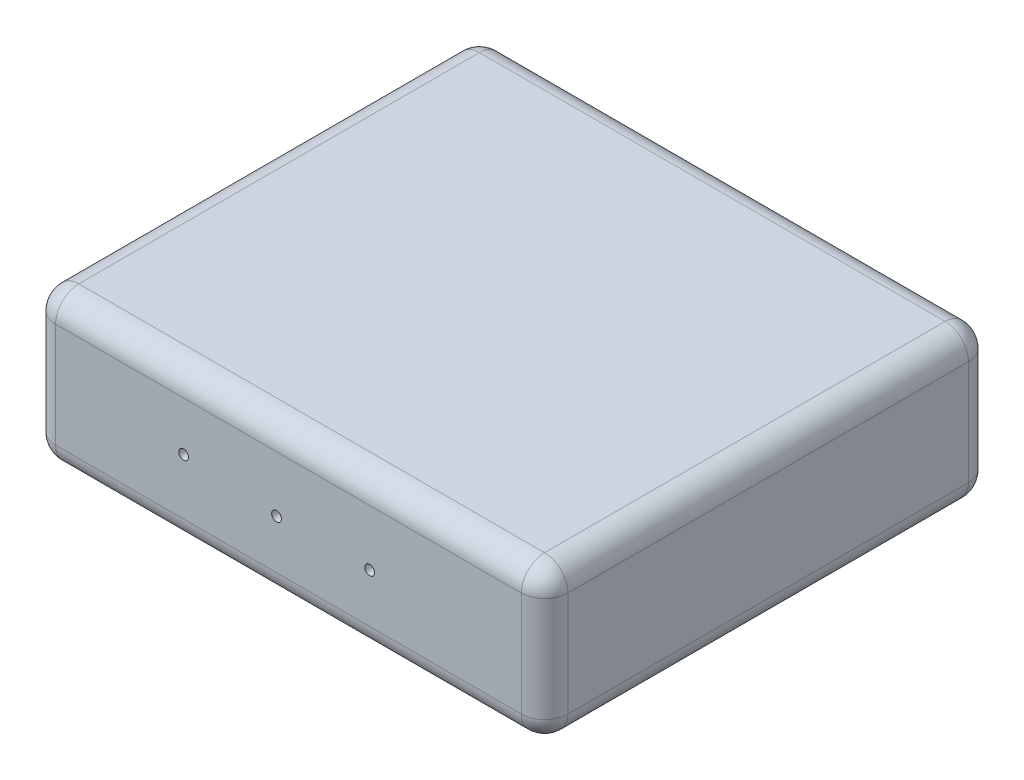
ISO-10303-21;
HEADER;
FILE_DESCRIPTION(('STEP AP214'),'2;1');
FILE_NAME('part.step','',(''),(''),'','','');
FILE_SCHEMA(('AUTOMOTIVE_DESIGN { 1 0 10303 214 1 1 1 1 }'));
ENDSEC;
DATA;
#1=APPLICATION_CONTEXT('core data for automotive mechanical design processes');
#2=APPLICATION_PROTOCOL_DEFINITION('international standard','automotive_design',2000,#1);
#3=PRODUCT_CONTEXT('',#1,'mechanical');
#4=PRODUCT('Part','Part','',(#3));
#5=PRODUCT_RELATED_PRODUCT_CATEGORY('part','',(#4));
#6=PRODUCT_DEFINITION_FORMATION('','',#4);
#7=PRODUCT_DEFINITION_CONTEXT('part definition',#1,'design');
#8=PRODUCT_DEFINITION('design','',#6,#7);
#9=PRODUCT_DEFINITION_SHAPE('','',#8);
#10=(LENGTH_UNIT() NAMED_UNIT(*) SI_UNIT(.MILLI.,.METRE.));
#11=(NAMED_UNIT(*) PLANE_ANGLE_UNIT() SI_UNIT($,.RADIAN.));
#12=(NAMED_UNIT(*) SI_UNIT($,.STERADIAN.) SOLID_ANGLE_UNIT());
#13=UNCERTAINTY_MEASURE_WITH_UNIT(LENGTH_MEASURE(1.E-05),#10,'distance_accuracy_value','');
#14=(GEOMETRIC_REPRESENTATION_CONTEXT(3) GLOBAL_UNCERTAINTY_ASSIGNED_CONTEXT((#13)) GLOBAL_UNIT_ASSIGNED_CONTEXT((#10,
#11,#12)) REPRESENTATION_CONTEXT('',''));
#15=CARTESIAN_POINT('',(0.,0.,0.));
#16=DIRECTION('',(0.,0.,1.));
#17=DIRECTION('',(1.,0.,0.));
#18=AXIS2_PLACEMENT_3D('',#15,#16,#17);
#19=CARTESIAN_POINT('',(-110.,65.,96.));
#20=DIRECTION('',(1.,0.,0.));
#21=DIRECTION('',(0.,0.,-1.));
#22=AXIS2_PLACEMENT_3D('',#19,#20,#21);
#23=PLANE('',#22);
#24=DIRECTION('',(0.,-1.,0.));
#25=VECTOR('',#24,1.);
#26=CARTESIAN_POINT('',(-110.,65.,-86.));
#27=LINE('',#26,#25);
#28=CARTESIAN_POINT('',(-110.,55.,-86.));
#29=VERTEX_POINT('',#28);
#30=CARTESIAN_POINT('',(-110.,10.,-86.));
#31=VERTEX_POINT('',#30);
#32=EDGE_CURVE('E227',#29,#31,#27,.T.);
#33=ORIENTED_EDGE('',*,*,#32,.T.);
#34=DIRECTION('',(0.,0.,1.));
#35=VECTOR('',#34,1.);
#36=CARTESIAN_POINT('',(-110.,10.,96.));
#37=LINE('',#36,#35);
#38=CARTESIAN_POINT('',(-110.,10.,86.));
#39=VERTEX_POINT('',#38);
#40=EDGE_CURVE('E229',#31,#39,#37,.T.);
#41=ORIENTED_EDGE('',*,*,#40,.T.);
#42=DIRECTION('',(0.,-1.,0.));
#43=VECTOR('',#42,1.);
#44=CARTESIAN_POINT('',(-110.,65.,86.));
#45=LINE('',#44,#43);
#46=CARTESIAN_POINT('',(-110.,55.,86.));
#47=VERTEX_POINT('',#46);
#48=EDGE_CURVE('E225',#39,#47,#45,.F.);
#49=ORIENTED_EDGE('',*,*,#48,.T.);
#50=DIRECTION('',(0.,0.,1.));
#51=VECTOR('',#50,1.);
#52=CARTESIAN_POINT('',(-110.,55.,-96.));
#53=LINE('',#52,#51);
#54=EDGE_CURVE('E223',#47,#29,#53,.F.);
#55=ORIENTED_EDGE('',*,*,#54,.T.);
#56=EDGE_LOOP('',(#33,#41,#49,#55));
#57=FACE_BOUND('',#56,.T.);
#58=ADVANCED_FACE('F33',(#57),#23,.F.);
#59=CARTESIAN_POINT('',(110.,65.,96.));
#60=DIRECTION('',(0.,0.,-1.));
#61=DIRECTION('',(-1.,0.,0.));
#62=AXIS2_PLACEMENT_3D('',#59,#60,#61);
#63=PLANE('',#62);
#64=CARTESIAN_POINT('',(-45.,34.,96.));
#65=DIRECTION('',(0.,0.,1.));
#66=DIRECTION('',(1.,0.,0.));
#67=AXIS2_PLACEMENT_3D('',#64,#65,#66);
#68=CIRCLE('',#67,2.1);
#69=CARTESIAN_POINT('',(-42.9,34.,96.));
#70=VERTEX_POINT('',#69);
#71=EDGE_CURVE('E168',#70,#70,#68,.T.);
#72=ORIENTED_EDGE('',*,*,#71,.F.);
#73=EDGE_LOOP('',(#72));
#74=FACE_BOUND('',#73,.T.);
#75=CARTESIAN_POINT('',(-5.11202760446174,31.0084020703346,96.));
#76=DIRECTION('',(0.,0.,1.));
#77=DIRECTION('',(1.,0.,0.));
#78=AXIS2_PLACEMENT_3D('',#75,#76,#77);
#79=CIRCLE('',#78,2.1);
#80=CARTESIAN_POINT('',(-3.01202760446174,31.0084020703346,96.));
#81=VERTEX_POINT('',#80);
#82=EDGE_CURVE('E174',#81,#81,#79,.T.);
#83=ORIENTED_EDGE('',*,*,#82,.F.);
#84=EDGE_LOOP('',(#83));
#85=FACE_BOUND('',#84,.T.);
#86=CARTESIAN_POINT('',(34.8879715180256,31.0000234660585,96.));
#87=DIRECTION('',(0.,0.,1.));
#88=DIRECTION('',(1.,0.,0.));
#89=AXIS2_PLACEMENT_3D('',#86,#87,#88);
#90=CIRCLE('',#89,2.1);
#91=CARTESIAN_POINT('',(36.9879715180256,31.0000234660585,96.));
#92=VERTEX_POINT('',#91);
#93=EDGE_CURVE('E180',#92,#92,#90,.T.);
#94=ORIENTED_EDGE('',*,*,#93,.F.);
#95=EDGE_LOOP('',(#94));
#96=FACE_BOUND('',#95,.T.);
#97=DIRECTION('',(1.,0.,0.));
#98=VECTOR('',#97,1.);
#99=CARTESIAN_POINT('',(110.,10.,96.));
#100=LINE('',#99,#98);
#101=CARTESIAN_POINT('',(-100.,10.,96.));
#102=VERTEX_POINT('',#101);
#103=CARTESIAN_POINT('',(100.,10.,96.));
#104=VERTEX_POINT('',#103);
#105=EDGE_CURVE('E200',#102,#104,#100,.T.);
#106=ORIENTED_EDGE('',*,*,#105,.T.);
#107=DIRECTION('',(0.,-1.,0.));
#108=VECTOR('',#107,1.);
#109=CARTESIAN_POINT('',(100.,65.,96.));
#110=LINE('',#109,#108);
#111=CARTESIAN_POINT('',(100.,55.,96.));
#112=VERTEX_POINT('',#111);
#113=EDGE_CURVE('E202',#104,#112,#110,.F.);
#114=ORIENTED_EDGE('',*,*,#113,.T.);
#115=DIRECTION('',(1.,0.,0.));
#116=VECTOR('',#115,1.);
#117=CARTESIAN_POINT('',(-110.,55.,96.));
#118=LINE('',#117,#116);
#119=CARTESIAN_POINT('',(-100.,55.,96.));
#120=VERTEX_POINT('',#119);
#121=EDGE_CURVE('E196',#112,#120,#118,.F.);
#122=ORIENTED_EDGE('',*,*,#121,.T.);
#123=DIRECTION('',(0.,-1.,0.));
#124=VECTOR('',#123,1.);
#125=CARTESIAN_POINT('',(-100.,65.,96.));
#126=LINE('',#125,#124);
#127=EDGE_CURVE('E198',#120,#102,#126,.T.);
#128=ORIENTED_EDGE('',*,*,#127,.T.);
#129=EDGE_LOOP('',(#106,#114,#122,#128));
#130=FACE_BOUND('',#129,.T.);
#131=ADVANCED_FACE('F374',(#74,#85,#96,#130),#63,.F.);
#132=CARTESIAN_POINT('',(110.,65.,96.));
#133=DIRECTION('',(-1.,0.,0.));
#134=DIRECTION('',(0.,0.,1.));
#135=AXIS2_PLACEMENT_3D('',#132,#133,#134);
#136=PLANE('',#135);
#137=DIRECTION('',(0.,0.,-1.));
#138=VECTOR('',#137,1.);
#139=CARTESIAN_POINT('',(110.,55.,96.));
#140=LINE('',#139,#138);
#141=CARTESIAN_POINT('',(110.,55.,-86.));
#142=VERTEX_POINT('',#141);
#143=CARTESIAN_POINT('',(110.,55.,86.));
#144=VERTEX_POINT('',#143);
#145=EDGE_CURVE('E187',#142,#144,#140,.F.);
#146=ORIENTED_EDGE('',*,*,#145,.T.);
#147=DIRECTION('',(0.,-1.,0.));
#148=VECTOR('',#147,1.);
#149=CARTESIAN_POINT('',(110.,65.,86.));
#150=LINE('',#149,#148);
#151=CARTESIAN_POINT('',(110.,10.,86.));
#152=VERTEX_POINT('',#151);
#153=EDGE_CURVE('E193',#144,#152,#150,.T.);
#154=ORIENTED_EDGE('',*,*,#153,.T.);
#155=DIRECTION('',(0.,0.,-1.));
#156=VECTOR('',#155,1.);
#157=CARTESIAN_POINT('',(110.,10.,96.));
#158=LINE('',#157,#156);
#159=CARTESIAN_POINT('',(110.,10.,-86.));
#160=VERTEX_POINT('',#159);
#161=EDGE_CURVE('E191',#152,#160,#158,.T.);
#162=ORIENTED_EDGE('',*,*,#161,.T.);
#163=DIRECTION('',(0.,-1.,0.));
#164=VECTOR('',#163,1.);
#165=CARTESIAN_POINT('',(110.,65.,-86.));
#166=LINE('',#165,#164);
#167=EDGE_CURVE('E189',#160,#142,#166,.F.);
#168=ORIENTED_EDGE('',*,*,#167,.T.);
#169=EDGE_LOOP('',(#146,#154,#162,#168));
#170=FACE_BOUND('',#169,.T.);
#171=ADVANCED_FACE('F332',(#170),#136,.F.);
#172=CARTESIAN_POINT('',(110.,65.,-96.));
#173=DIRECTION('',(0.,0.,1.));
#174=DIRECTION('',(1.,0.,0.));
#175=AXIS2_PLACEMENT_3D('',#172,#173,#174);
#176=PLANE('',#175);
#177=CARTESIAN_POINT('',(45.,34.,-96.));
#178=DIRECTION('',(0.,0.,-1.));
#179=DIRECTION('',(-1.,0.,0.));
#180=AXIS2_PLACEMENT_3D('',#177,#178,#179);
#181=CIRCLE('',#180,2.1);
#182=CARTESIAN_POINT('',(42.9,34.,-96.));
#183=VERTEX_POINT('',#182);
#184=EDGE_CURVE('E152',#183,#183,#181,.T.);
#185=ORIENTED_EDGE('',*,*,#184,.F.);
#186=EDGE_LOOP('',(#185));
#187=FACE_BOUND('',#186,.T.);
#188=CARTESIAN_POINT('',(5.11202760446174,31.0084020703346,-96.));
#189=DIRECTION('',(0.,0.,-1.));
#190=DIRECTION('',(-1.,0.,0.));
#191=AXIS2_PLACEMENT_3D('',#188,#189,#190);
#192=CIRCLE('',#191,2.1);
#193=CARTESIAN_POINT('',(3.01202760446174,31.0084020703346,-96.));
#194=VERTEX_POINT('',#193);
#195=EDGE_CURVE('E151',#194,#194,#192,.T.);
#196=ORIENTED_EDGE('',*,*,#195,.F.);
#197=EDGE_LOOP('',(#196));
#198=FACE_BOUND('',#197,.T.);
#199=CARTESIAN_POINT('',(-34.8879715180256,31.0000234660584,-96.));
#200=DIRECTION('',(0.,0.,-1.));
#201=DIRECTION('',(-1.,0.,0.));
#202=AXIS2_PLACEMENT_3D('',#199,#200,#201);
#203=CIRCLE('',#202,2.1);
#204=CARTESIAN_POINT('',(-36.9879715180256,31.0000234660584,-96.));
#205=VERTEX_POINT('',#204);
#206=EDGE_CURVE('E162',#205,#205,#203,.T.);
#207=ORIENTED_EDGE('',*,*,#206,.F.);
#208=EDGE_LOOP('',(#207));
#209=FACE_BOUND('',#208,.T.);
#210=DIRECTION('',(-1.,0.,0.));
#211=VECTOR('',#210,1.);
#212=CARTESIAN_POINT('',(110.,55.,-96.));
#213=LINE('',#212,#211);
#214=CARTESIAN_POINT('',(-100.,55.,-96.));
#215=VERTEX_POINT('',#214);
#216=CARTESIAN_POINT('',(100.,55.,-96.));
#217=VERTEX_POINT('',#216);
#218=EDGE_CURVE('E214',#215,#217,#213,.F.);
#219=ORIENTED_EDGE('',*,*,#218,.T.);
#220=DIRECTION('',(0.,-1.,0.));
#221=VECTOR('',#220,1.);
#222=CARTESIAN_POINT('',(100.,65.,-96.));
#223=LINE('',#222,#221);
#224=CARTESIAN_POINT('',(100.,10.,-96.));
#225=VERTEX_POINT('',#224);
#226=EDGE_CURVE('E220',#217,#225,#223,.T.);
#227=ORIENTED_EDGE('',*,*,#226,.T.);
#228=DIRECTION('',(-1.,0.,0.));
#229=VECTOR('',#228,1.);
#230=CARTESIAN_POINT('',(110.,10.,-96.));
#231=LINE('',#230,#229);
#232=CARTESIAN_POINT('',(-100.,10.,-96.));
#233=VERTEX_POINT('',#232);
#234=EDGE_CURVE('E218',#225,#233,#231,.T.);
#235=ORIENTED_EDGE('',*,*,#234,.T.);
#236=DIRECTION('',(0.,-1.,0.));
#237=VECTOR('',#236,1.);
#238=CARTESIAN_POINT('',(-100.,65.,-96.));
#239=LINE('',#238,#237);
#240=EDGE_CURVE('E216',#233,#215,#239,.F.);
#241=ORIENTED_EDGE('',*,*,#240,.T.);
#242=EDGE_LOOP('',(#219,#227,#235,#241));
#243=FACE_BOUND('',#242,.T.);
#244=ADVANCED_FACE('F346',(#187,#198,#209,#243),#176,.F.);
#245=CARTESIAN_POINT('',(0.,65.,0.));
#246=DIRECTION('',(0.,1.,0.));
#247=DIRECTION('',(0.,0.,1.));
#248=AXIS2_PLACEMENT_3D('',#245,#246,#247);
#249=PLANE('',#248);
#250=DIRECTION('',(1.,0.,0.));
#251=VECTOR('',#250,1.);
#252=CARTESIAN_POINT('',(110.,65.,86.));
#253=LINE('',#252,#251);
#254=CARTESIAN_POINT('',(-100.,65.,86.));
#255=VERTEX_POINT('',#254);
#256=CARTESIAN_POINT('',(100.,65.,86.));
#257=VERTEX_POINT('',#256);
#258=EDGE_CURVE('E232',#255,#257,#253,.T.);
#259=ORIENTED_EDGE('',*,*,#258,.T.);
#260=DIRECTION('',(0.,0.,-1.));
#261=VECTOR('',#260,1.);
#262=CARTESIAN_POINT('',(100.,65.,-96.));
#263=LINE('',#262,#261);
#264=CARTESIAN_POINT('',(100.,65.,-86.));
#265=VERTEX_POINT('',#264);
#266=EDGE_CURVE('E11',#257,#265,#263,.T.);
#267=ORIENTED_EDGE('',*,*,#266,.T.);
#268=DIRECTION('',(-1.,0.,0.));
#269=VECTOR('',#268,1.);
#270=CARTESIAN_POINT('',(-110.,65.,-86.));
#271=LINE('',#270,#269);
#272=CARTESIAN_POINT('',(-100.,65.,-86.));
#273=VERTEX_POINT('',#272);
#274=EDGE_CURVE('E42',#265,#273,#271,.T.);
#275=ORIENTED_EDGE('',*,*,#274,.T.);
#276=DIRECTION('',(0.,0.,1.));
#277=VECTOR('',#276,1.);
#278=CARTESIAN_POINT('',(-100.,65.,96.));
#279=LINE('',#278,#277);
#280=EDGE_CURVE('E234',#273,#255,#279,.T.);
#281=ORIENTED_EDGE('',*,*,#280,.T.);
#282=EDGE_LOOP('',(#259,#267,#275,#281));
#283=FACE_BOUND('',#282,.T.);
#284=ADVANCED_FACE('F315',(#283),#249,.T.);
#285=CARTESIAN_POINT('',(0.,0.,0.));
#286=DIRECTION('',(0.,1.,0.));
#287=DIRECTION('',(0.,0.,1.));
#288=AXIS2_PLACEMENT_3D('',#285,#286,#287);
#289=PLANE('',#288);
#290=DIRECTION('',(-1.,0.,0.));
#291=VECTOR('',#290,1.);
#292=CARTESIAN_POINT('',(0.,0.,-86.));
#293=LINE('',#292,#291);
#294=CARTESIAN_POINT('',(-100.,0.,-86.));
#295=VERTEX_POINT('',#294);
#296=CARTESIAN_POINT('',(100.,0.,-86.));
#297=VERTEX_POINT('',#296);
#298=EDGE_CURVE('E209',#295,#297,#293,.F.);
#299=ORIENTED_EDGE('',*,*,#298,.T.);
#300=DIRECTION('',(0.,0.,-1.));
#301=VECTOR('',#300,1.);
#302=CARTESIAN_POINT('',(100.,0.,0.));
#303=LINE('',#302,#301);
#304=CARTESIAN_POINT('',(100.,0.,86.));
#305=VERTEX_POINT('',#304);
#306=EDGE_CURVE('E211',#297,#305,#303,.F.);
#307=ORIENTED_EDGE('',*,*,#306,.T.);
#308=DIRECTION('',(1.,0.,0.));
#309=VECTOR('',#308,1.);
#310=CARTESIAN_POINT('',(0.,0.,86.));
#311=LINE('',#310,#309);
#312=CARTESIAN_POINT('',(-100.,0.,86.));
#313=VERTEX_POINT('',#312);
#314=EDGE_CURVE('E205',#305,#313,#311,.F.);
#315=ORIENTED_EDGE('',*,*,#314,.T.);
#316=DIRECTION('',(0.,0.,1.));
#317=VECTOR('',#316,1.);
#318=CARTESIAN_POINT('',(-100.,0.,0.));
#319=LINE('',#318,#317);
#320=EDGE_CURVE('E207',#313,#295,#319,.F.);
#321=ORIENTED_EDGE('',*,*,#320,.T.);
#322=EDGE_LOOP('',(#299,#307,#315,#321));
#323=FACE_BOUND('',#322,.T.);
#324=ADVANCED_FACE('F418',(#323),#289,.F.);
#325=CARTESIAN_POINT('',(-100.,65.,-86.));
#326=DIRECTION('',(0.,-1.,0.));
#327=DIRECTION('',(0.,0.,-1.));
#328=AXIS2_PLACEMENT_3D('',#325,#326,#327);
#329=CYLINDRICAL_SURFACE('',#328,10.);
#330=CARTESIAN_POINT('',(-100.,55.,-86.));
#331=DIRECTION('',(0.,1.,0.));
#332=DIRECTION('',(0.,0.,1.));
#333=AXIS2_PLACEMENT_3D('',#330,#331,#332);
#334=CIRCLE('',#333,10.);
#335=EDGE_CURVE('E37',#215,#29,#334,.T.);
#336=ORIENTED_EDGE('',*,*,#335,.F.);
#337=ORIENTED_EDGE('',*,*,#240,.F.);
#338=CARTESIAN_POINT('',(-100.,10.,-86.));
#339=DIRECTION('',(0.,-1.,0.));
#340=DIRECTION('',(0.,0.,-1.));
#341=AXIS2_PLACEMENT_3D('',#338,#339,#340);
#342=CIRCLE('',#341,10.);
#343=EDGE_CURVE('E292',#31,#233,#342,.T.);
#344=ORIENTED_EDGE('',*,*,#343,.F.);
#345=ORIENTED_EDGE('',*,*,#32,.F.);
#346=EDGE_LOOP('',(#336,#337,#344,#345));
#347=FACE_BOUND('',#346,.T.);
#348=ADVANCED_FACE('F35',(#347),#329,.T.);
#349=CARTESIAN_POINT('',(-100.,55.,-86.));
#350=DIRECTION('',(0.,0.,1.));
#351=DIRECTION('',(1.,0.,0.));
#352=AXIS2_PLACEMENT_3D('',#349,#350,#351);
#353=SPHERICAL_SURFACE('',#352,10.);
#354=CARTESIAN_POINT('',(-100.,55.,-86.));
#355=DIRECTION('',(-1.,0.,0.));
#356=DIRECTION('',(0.,0.,1.));
#357=AXIS2_PLACEMENT_3D('',#354,#355,#356);
#358=CIRCLE('',#357,10.);
#359=EDGE_CURVE('E288',#215,#273,#358,.F.);
#360=ORIENTED_EDGE('',*,*,#359,.F.);
#361=ORIENTED_EDGE('',*,*,#335,.T.);
#362=CARTESIAN_POINT('',(-100.,55.,-86.));
#363=DIRECTION('',(0.,0.,-1.));
#364=DIRECTION('',(0.,1.,0.));
#365=AXIS2_PLACEMENT_3D('',#362,#363,#364);
#366=CIRCLE('',#365,10.);
#367=EDGE_CURVE('E290',#273,#29,#366,.F.);
#368=ORIENTED_EDGE('',*,*,#367,.F.);
#369=EDGE_LOOP('',(#360,#361,#368));
#370=FACE_BOUND('',#369,.T.);
#371=ADVANCED_FACE('F303',(#370),#353,.T.);
#372=CARTESIAN_POINT('',(-100.,10.,-86.));
#373=DIRECTION('',(0.,0.,1.));
#374=DIRECTION('',(1.,0.,0.));
#375=AXIS2_PLACEMENT_3D('',#372,#373,#374);
#376=SPHERICAL_SURFACE('',#375,10.);
#377=CARTESIAN_POINT('',(-100.,10.,-86.));
#378=DIRECTION('',(0.,0.,-1.));
#379=DIRECTION('',(-1.,0.,0.));
#380=AXIS2_PLACEMENT_3D('',#377,#378,#379);
#381=CIRCLE('',#380,10.);
#382=EDGE_CURVE('E282',#31,#295,#381,.F.);
#383=ORIENTED_EDGE('',*,*,#382,.F.);
#384=ORIENTED_EDGE('',*,*,#343,.T.);
#385=CARTESIAN_POINT('',(-100.,10.,-86.));
#386=DIRECTION('',(-1.,0.,0.));
#387=DIRECTION('',(0.,0.,1.));
#388=AXIS2_PLACEMENT_3D('',#385,#386,#387);
#389=CIRCLE('',#388,10.);
#390=EDGE_CURVE('E285',#295,#233,#389,.F.);
#391=ORIENTED_EDGE('',*,*,#390,.F.);
#392=EDGE_LOOP('',(#383,#384,#391));
#393=FACE_BOUND('',#392,.T.);
#394=ADVANCED_FACE('F349',(#393),#376,.T.);
#395=CARTESIAN_POINT('',(-100.,55.,0.));
#396=DIRECTION('',(0.,0.,-1.));
#397=DIRECTION('',(-1.,0.,0.));
#398=AXIS2_PLACEMENT_3D('',#395,#396,#397);
#399=CYLINDRICAL_SURFACE('',#398,10.);
#400=ORIENTED_EDGE('',*,*,#367,.T.);
#401=ORIENTED_EDGE('',*,*,#54,.F.);
#402=CARTESIAN_POINT('',(-100.,55.,86.));
#403=DIRECTION('',(0.,0.,1.));
#404=DIRECTION('',(1.,0.,0.));
#405=AXIS2_PLACEMENT_3D('',#402,#403,#404);
#406=CIRCLE('',#405,10.);
#407=EDGE_CURVE('E276',#255,#47,#406,.T.);
#408=ORIENTED_EDGE('',*,*,#407,.F.);
#409=ORIENTED_EDGE('',*,*,#280,.F.);
#410=EDGE_LOOP('',(#400,#401,#408,#409));
#411=FACE_BOUND('',#410,.T.);
#412=ADVANCED_FACE('F311',(#411),#399,.T.);
#413=CARTESIAN_POINT('',(0.,55.,-86.));
#414=DIRECTION('',(1.,0.,0.));
#415=DIRECTION('',(0.,0.,-1.));
#416=AXIS2_PLACEMENT_3D('',#413,#414,#415);
#417=CYLINDRICAL_SURFACE('',#416,10.);
#418=ORIENTED_EDGE('',*,*,#359,.T.);
#419=ORIENTED_EDGE('',*,*,#274,.F.);
#420=CARTESIAN_POINT('',(100.,55.,-86.));
#421=DIRECTION('',(1.,0.,0.));
#422=DIRECTION('',(0.,0.,-1.));
#423=AXIS2_PLACEMENT_3D('',#420,#421,#422);
#424=CIRCLE('',#423,10.);
#425=EDGE_CURVE('E274',#217,#265,#424,.T.);
#426=ORIENTED_EDGE('',*,*,#425,.F.);
#427=ORIENTED_EDGE('',*,*,#218,.F.);
#428=EDGE_LOOP('',(#418,#419,#426,#427));
#429=FACE_BOUND('',#428,.T.);
#430=ADVANCED_FACE('F344',(#429),#417,.T.);
#431=CARTESIAN_POINT('',(100.,65.,-86.));
#432=DIRECTION('',(0.,-1.,0.));
#433=DIRECTION('',(0.,0.,-1.));
#434=AXIS2_PLACEMENT_3D('',#431,#432,#433);
#435=CYLINDRICAL_SURFACE('',#434,10.);
#436=CARTESIAN_POINT('',(100.,10.,-86.));
#437=DIRECTION('',(0.,-1.,0.));
#438=DIRECTION('',(0.,0.,-1.));
#439=AXIS2_PLACEMENT_3D('',#436,#437,#438);
#440=CIRCLE('',#439,10.);
#441=EDGE_CURVE('E268',#225,#160,#440,.T.);
#442=ORIENTED_EDGE('',*,*,#441,.F.);
#443=ORIENTED_EDGE('',*,*,#226,.F.);
#444=CARTESIAN_POINT('',(100.,55.,-86.));
#445=DIRECTION('',(0.,1.,0.));
#446=DIRECTION('',(0.,0.,1.));
#447=AXIS2_PLACEMENT_3D('',#444,#445,#446);
#448=CIRCLE('',#447,10.);
#449=EDGE_CURVE('E271',#142,#217,#448,.T.);
#450=ORIENTED_EDGE('',*,*,#449,.F.);
#451=ORIENTED_EDGE('',*,*,#167,.F.);
#452=EDGE_LOOP('',(#442,#443,#450,#451));
#453=FACE_BOUND('',#452,.T.);
#454=ADVANCED_FACE('F339',(#453),#435,.T.);
#455=CARTESIAN_POINT('',(110.,10.,-86.));
#456=DIRECTION('',(-1.,0.,0.));
#457=DIRECTION('',(0.,0.,1.));
#458=AXIS2_PLACEMENT_3D('',#455,#456,#457);
#459=CYLINDRICAL_SURFACE('',#458,10.);
#460=ORIENTED_EDGE('',*,*,#390,.T.);
#461=ORIENTED_EDGE('',*,*,#234,.F.);
#462=CARTESIAN_POINT('',(100.,10.,-86.));
#463=DIRECTION('',(1.,0.,0.));
#464=DIRECTION('',(0.,0.,-1.));
#465=AXIS2_PLACEMENT_3D('',#462,#463,#464);
#466=CIRCLE('',#465,10.);
#467=EDGE_CURVE('E266',#297,#225,#466,.T.);
#468=ORIENTED_EDGE('',*,*,#467,.F.);
#469=ORIENTED_EDGE('',*,*,#298,.F.);
#470=EDGE_LOOP('',(#460,#461,#468,#469));
#471=FACE_BOUND('',#470,.T.);
#472=ADVANCED_FACE('F416',(#471),#459,.T.);
#473=CARTESIAN_POINT('',(-100.,10.,96.));
#474=DIRECTION('',(0.,0.,1.));
#475=DIRECTION('',(1.,0.,0.));
#476=AXIS2_PLACEMENT_3D('',#473,#474,#475);
#477=CYLINDRICAL_SURFACE('',#476,10.);
#478=ORIENTED_EDGE('',*,*,#382,.T.);
#479=ORIENTED_EDGE('',*,*,#320,.F.);
#480=CARTESIAN_POINT('',(-100.,10.,86.));
#481=DIRECTION('',(0.,0.,1.));
#482=DIRECTION('',(1.,0.,0.));
#483=AXIS2_PLACEMENT_3D('',#480,#481,#482);
#484=CIRCLE('',#483,10.);
#485=EDGE_CURVE('E263',#39,#313,#484,.T.);
#486=ORIENTED_EDGE('',*,*,#485,.F.);
#487=ORIENTED_EDGE('',*,*,#40,.F.);
#488=EDGE_LOOP('',(#478,#479,#486,#487));
#489=FACE_BOUND('',#488,.T.);
#490=ADVANCED_FACE('F354',(#489),#477,.T.);
#491=CARTESIAN_POINT('',(-100.,65.,86.));
#492=DIRECTION('',(0.,-1.,0.));
#493=DIRECTION('',(0.,0.,-1.));
#494=AXIS2_PLACEMENT_3D('',#491,#492,#493);
#495=CYLINDRICAL_SURFACE('',#494,10.);
#496=CARTESIAN_POINT('',(-100.,55.,86.));
#497=DIRECTION('',(0.,1.,0.));
#498=DIRECTION('',(0.,0.,1.));
#499=AXIS2_PLACEMENT_3D('',#496,#497,#498);
#500=CIRCLE('',#499,10.);
#501=EDGE_CURVE('E279',#47,#120,#500,.T.);
#502=ORIENTED_EDGE('',*,*,#501,.F.);
#503=ORIENTED_EDGE('',*,*,#48,.F.);
#504=CARTESIAN_POINT('',(-100.,10.,86.));
#505=DIRECTION('',(0.,-1.,0.));
#506=DIRECTION('',(0.,0.,-1.));
#507=AXIS2_PLACEMENT_3D('',#504,#505,#506);
#508=CIRCLE('',#507,10.);
#509=EDGE_CURVE('E261',#102,#39,#508,.T.);
#510=ORIENTED_EDGE('',*,*,#509,.F.);
#511=ORIENTED_EDGE('',*,*,#127,.F.);
#512=EDGE_LOOP('',(#502,#503,#510,#511));
#513=FACE_BOUND('',#512,.T.);
#514=ADVANCED_FACE('F359',(#513),#495,.T.);
#515=CARTESIAN_POINT('',(-100.,55.,86.));
#516=DIRECTION('',(0.,0.,1.));
#517=DIRECTION('',(1.,0.,0.));
#518=AXIS2_PLACEMENT_3D('',#515,#516,#517);
#519=SPHERICAL_SURFACE('',#518,10.);
#520=ORIENTED_EDGE('',*,*,#407,.T.);
#521=ORIENTED_EDGE('',*,*,#501,.T.);
#522=CARTESIAN_POINT('',(-100.,55.,86.));
#523=DIRECTION('',(-1.,0.,0.));
#524=DIRECTION('',(0.,-1.,0.));
#525=AXIS2_PLACEMENT_3D('',#522,#523,#524);
#526=CIRCLE('',#525,10.);
#527=EDGE_CURVE('E258',#255,#120,#526,.F.);
#528=ORIENTED_EDGE('',*,*,#527,.F.);
#529=EDGE_LOOP('',(#520,#521,#528));
#530=FACE_BOUND('',#529,.T.);
#531=ADVANCED_FACE('F363',(#530),#519,.T.);
#532=CARTESIAN_POINT('',(100.,55.,-86.));
#533=DIRECTION('',(0.,0.,1.));
#534=DIRECTION('',(1.,0.,0.));
#535=AXIS2_PLACEMENT_3D('',#532,#533,#534);
#536=SPHERICAL_SURFACE('',#535,10.);
#537=ORIENTED_EDGE('',*,*,#449,.T.);
#538=ORIENTED_EDGE('',*,*,#425,.T.);
#539=CARTESIAN_POINT('',(100.,55.,-86.));
#540=DIRECTION('',(0.,0.,-1.));
#541=DIRECTION('',(-1.,0.,0.));
#542=AXIS2_PLACEMENT_3D('',#539,#540,#541);
#543=CIRCLE('',#542,10.);
#544=EDGE_CURVE('E50',#142,#265,#543,.F.);
#545=ORIENTED_EDGE('',*,*,#544,.F.);
#546=EDGE_LOOP('',(#537,#538,#545));
#547=FACE_BOUND('',#546,.T.);
#548=ADVANCED_FACE('F342',(#547),#536,.T.);
#549=CARTESIAN_POINT('',(100.,10.,-86.));
#550=DIRECTION('',(0.,0.,1.));
#551=DIRECTION('',(1.,0.,0.));
#552=AXIS2_PLACEMENT_3D('',#549,#550,#551);
#553=SPHERICAL_SURFACE('',#552,10.);
#554=ORIENTED_EDGE('',*,*,#467,.T.);
#555=ORIENTED_EDGE('',*,*,#441,.T.);
#556=CARTESIAN_POINT('',(100.,10.,-86.));
#557=DIRECTION('',(0.,0.,-1.));
#558=DIRECTION('',(-1.,0.,0.));
#559=AXIS2_PLACEMENT_3D('',#556,#557,#558);
#560=CIRCLE('',#559,10.);
#561=EDGE_CURVE('E254',#297,#160,#560,.F.);
#562=ORIENTED_EDGE('',*,*,#561,.F.);
#563=EDGE_LOOP('',(#554,#555,#562));
#564=FACE_BOUND('',#563,.T.);
#565=ADVANCED_FACE('F370',(#564),#553,.T.);
#566=CARTESIAN_POINT('',(-100.,10.,86.));
#567=DIRECTION('',(0.,0.,1.));
#568=DIRECTION('',(1.,0.,0.));
#569=AXIS2_PLACEMENT_3D('',#566,#567,#568);
#570=SPHERICAL_SURFACE('',#569,10.);
#571=ORIENTED_EDGE('',*,*,#509,.T.);
#572=ORIENTED_EDGE('',*,*,#485,.T.);
#573=CARTESIAN_POINT('',(-100.,10.,86.));
#574=DIRECTION('',(-1.,0.,0.));
#575=DIRECTION('',(0.,0.,1.));
#576=AXIS2_PLACEMENT_3D('',#573,#574,#575);
#577=CIRCLE('',#576,10.);
#578=EDGE_CURVE('E251',#102,#313,#577,.F.);
#579=ORIENTED_EDGE('',*,*,#578,.F.);
#580=EDGE_LOOP('',(#571,#572,#579));
#581=FACE_BOUND('',#580,.T.);
#582=ADVANCED_FACE('F404',(#581),#570,.T.);
#583=CARTESIAN_POINT('',(0.,55.,86.));
#584=DIRECTION('',(-1.,0.,0.));
#585=DIRECTION('',(0.,0.,1.));
#586=AXIS2_PLACEMENT_3D('',#583,#584,#585);
#587=CYLINDRICAL_SURFACE('',#586,10.);
#588=ORIENTED_EDGE('',*,*,#527,.T.);
#589=ORIENTED_EDGE('',*,*,#121,.F.);
#590=CARTESIAN_POINT('',(100.,55.,86.));
#591=DIRECTION('',(1.,0.,0.));
#592=DIRECTION('',(0.,0.,-1.));
#593=AXIS2_PLACEMENT_3D('',#590,#591,#592);
#594=CIRCLE('',#593,10.);
#595=EDGE_CURVE('E248',#257,#112,#594,.T.);
#596=ORIENTED_EDGE('',*,*,#595,.F.);
#597=ORIENTED_EDGE('',*,*,#258,.F.);
#598=EDGE_LOOP('',(#588,#589,#596,#597));
#599=FACE_BOUND('',#598,.T.);
#600=ADVANCED_FACE('F323',(#599),#587,.T.);
#601=CARTESIAN_POINT('',(100.,55.,0.));
#602=DIRECTION('',(0.,0.,1.));
#603=DIRECTION('',(1.,0.,0.));
#604=AXIS2_PLACEMENT_3D('',#601,#602,#603);
#605=CYLINDRICAL_SURFACE('',#604,10.);
#606=ORIENTED_EDGE('',*,*,#544,.T.);
#607=ORIENTED_EDGE('',*,*,#266,.F.);
#608=CARTESIAN_POINT('',(100.,55.,86.));
#609=DIRECTION('',(0.,0.,1.));
#610=DIRECTION('',(1.,0.,0.));
#611=AXIS2_PLACEMENT_3D('',#608,#609,#610);
#612=CIRCLE('',#611,10.);
#613=EDGE_CURVE('E245',#144,#257,#612,.T.);
#614=ORIENTED_EDGE('',*,*,#613,.F.);
#615=ORIENTED_EDGE('',*,*,#145,.F.);
#616=EDGE_LOOP('',(#606,#607,#614,#615));
#617=FACE_BOUND('',#616,.T.);
#618=ADVANCED_FACE('F320',(#617),#605,.T.);
#619=CARTESIAN_POINT('',(100.,10.,96.));
#620=DIRECTION('',(0.,0.,-1.));
#621=DIRECTION('',(-1.,0.,0.));
#622=AXIS2_PLACEMENT_3D('',#619,#620,#621);
#623=CYLINDRICAL_SURFACE('',#622,10.);
#624=ORIENTED_EDGE('',*,*,#561,.T.);
#625=ORIENTED_EDGE('',*,*,#161,.F.);
#626=CARTESIAN_POINT('',(100.,10.,86.));
#627=DIRECTION('',(0.,0.,1.));
#628=DIRECTION('',(1.,0.,0.));
#629=AXIS2_PLACEMENT_3D('',#626,#627,#628);
#630=CIRCLE('',#629,10.);
#631=EDGE_CURVE('E242',#305,#152,#630,.T.);
#632=ORIENTED_EDGE('',*,*,#631,.F.);
#633=ORIENTED_EDGE('',*,*,#306,.F.);
#634=EDGE_LOOP('',(#624,#625,#632,#633));
#635=FACE_BOUND('',#634,.T.);
#636=ADVANCED_FACE('F395',(#635),#623,.T.);
#637=CARTESIAN_POINT('',(110.,10.,86.));
#638=DIRECTION('',(1.,0.,0.));
#639=DIRECTION('',(0.,0.,-1.));
#640=AXIS2_PLACEMENT_3D('',#637,#638,#639);
#641=CYLINDRICAL_SURFACE('',#640,10.);
#642=ORIENTED_EDGE('',*,*,#578,.T.);
#643=ORIENTED_EDGE('',*,*,#314,.F.);
#644=CARTESIAN_POINT('',(100.,10.,86.));
#645=DIRECTION('',(1.,0.,0.));
#646=DIRECTION('',(0.,0.,-1.));
#647=AXIS2_PLACEMENT_3D('',#644,#645,#646);
#648=CIRCLE('',#647,10.);
#649=EDGE_CURVE('E240',#104,#305,#648,.T.);
#650=ORIENTED_EDGE('',*,*,#649,.F.);
#651=ORIENTED_EDGE('',*,*,#105,.F.);
#652=EDGE_LOOP('',(#642,#643,#650,#651));
#653=FACE_BOUND('',#652,.T.);
#654=ADVANCED_FACE('F392',(#653),#641,.T.);
#655=CARTESIAN_POINT('',(100.,55.,86.));
#656=DIRECTION('',(0.,0.,1.));
#657=DIRECTION('',(1.,0.,0.));
#658=AXIS2_PLACEMENT_3D('',#655,#656,#657);
#659=SPHERICAL_SURFACE('',#658,10.);
#660=ORIENTED_EDGE('',*,*,#613,.T.);
#661=ORIENTED_EDGE('',*,*,#595,.T.);
#662=CARTESIAN_POINT('',(100.,55.,86.));
#663=DIRECTION('',(0.,1.,0.));
#664=DIRECTION('',(0.,0.,1.));
#665=AXIS2_PLACEMENT_3D('',#662,#663,#664);
#666=CIRCLE('',#665,10.);
#667=EDGE_CURVE('E238',#144,#112,#666,.F.);
#668=ORIENTED_EDGE('',*,*,#667,.F.);
#669=EDGE_LOOP('',(#660,#661,#668));
#670=FACE_BOUND('',#669,.T.);
#671=ADVANCED_FACE('F325',(#670),#659,.T.);
#672=CARTESIAN_POINT('',(100.,10.,86.));
#673=DIRECTION('',(0.,0.,1.));
#674=DIRECTION('',(1.,0.,0.));
#675=AXIS2_PLACEMENT_3D('',#672,#673,#674);
#676=SPHERICAL_SURFACE('',#675,10.);
#677=ORIENTED_EDGE('',*,*,#649,.T.);
#678=ORIENTED_EDGE('',*,*,#631,.T.);
#679=CARTESIAN_POINT('',(100.,10.,86.));
#680=DIRECTION('',(0.,-1.,0.));
#681=DIRECTION('',(0.,0.,-1.));
#682=AXIS2_PLACEMENT_3D('',#679,#680,#681);
#683=CIRCLE('',#682,10.);
#684=EDGE_CURVE('E186',#104,#152,#683,.F.);
#685=ORIENTED_EDGE('',*,*,#684,.F.);
#686=EDGE_LOOP('',(#677,#678,#685));
#687=FACE_BOUND('',#686,.T.);
#688=ADVANCED_FACE('F386',(#687),#676,.T.);
#689=CARTESIAN_POINT('',(100.,65.,86.));
#690=DIRECTION('',(0.,-1.,0.));
#691=DIRECTION('',(0.,0.,-1.));
#692=AXIS2_PLACEMENT_3D('',#689,#690,#691);
#693=CYLINDRICAL_SURFACE('',#692,10.);
#694=ORIENTED_EDGE('',*,*,#667,.T.);
#695=ORIENTED_EDGE('',*,*,#113,.F.);
#696=ORIENTED_EDGE('',*,*,#684,.T.);
#697=ORIENTED_EDGE('',*,*,#153,.F.);
#698=EDGE_LOOP('',(#694,#695,#696,#697));
#699=FACE_BOUND('',#698,.T.);
#700=ADVANCED_FACE('F329',(#699),#693,.T.);
#701=CARTESIAN_POINT('',(34.8879715180256,31.0000234660585,86.));
#702=DIRECTION('',(0.,0.,1.));
#703=DIRECTION('',(1.,0.,0.));
#704=AXIS2_PLACEMENT_3D('',#701,#702,#703);
#705=CONICAL_SURFACE('',#704,2.1,1.02974425867665);
#706=CARTESIAN_POINT('',(34.8879715180256,31.0000234660585,84.7381927000421));
#707=VERTEX_POINT('',#706);
#708=VERTEX_LOOP('',#707);
#709=FACE_BOUND('',#708,.T.);
#710=CARTESIAN_POINT('',(34.8879715180256,31.0000234660585,86.));
#711=DIRECTION('',(0.,0.,1.));
#712=DIRECTION('',(1.,0.,0.));
#713=AXIS2_PLACEMENT_3D('',#710,#711,#712);
#714=CIRCLE('',#713,2.1);
#715=CARTESIAN_POINT('',(36.9879715180256,31.0000234660585,86.));
#716=VERTEX_POINT('',#715);
#717=EDGE_CURVE('E183',#716,#716,#714,.T.);
#718=ORIENTED_EDGE('',*,*,#717,.T.);
#719=EDGE_LOOP('',(#718));
#720=FACE_BOUND('',#719,.T.);
#721=ADVANCED_FACE('F385',(#709,#720),#705,.F.);
#722=CARTESIAN_POINT('',(34.8879715180256,31.0000234660585,96.));
#723=DIRECTION('',(0.,0.,1.));
#724=DIRECTION('',(1.,0.,0.));
#725=AXIS2_PLACEMENT_3D('',#722,#723,#724);
#726=CYLINDRICAL_SURFACE('',#725,2.1);
#727=ORIENTED_EDGE('',*,*,#717,.F.);
#728=EDGE_LOOP('',(#727));
#729=FACE_BOUND('',#728,.T.);
#730=ORIENTED_EDGE('',*,*,#93,.T.);
#731=EDGE_LOOP('',(#730));
#732=FACE_BOUND('',#731,.T.);
#733=ADVANCED_FACE('F597',(#729,#732),#726,.F.);
#734=CARTESIAN_POINT('',(-5.11202760446174,31.0084020703346,86.));
#735=DIRECTION('',(0.,0.,1.));
#736=DIRECTION('',(1.,0.,0.));
#737=AXIS2_PLACEMENT_3D('',#734,#735,#736);
#738=CONICAL_SURFACE('',#737,2.1,1.02974425867665);
#739=CARTESIAN_POINT('',(-5.11202760446175,31.0084020703346,84.7381927000421));
#740=VERTEX_POINT('',#739);
#741=VERTEX_LOOP('',#740);
#742=FACE_BOUND('',#741,.T.);
#743=CARTESIAN_POINT('',(-5.11202760446174,31.0084020703346,86.));
#744=DIRECTION('',(0.,0.,1.));
#745=DIRECTION('',(1.,0.,0.));
#746=AXIS2_PLACEMENT_3D('',#743,#744,#745);
#747=CIRCLE('',#746,2.1);
#748=CARTESIAN_POINT('',(-3.01202760446175,31.0084020703346,86.));
#749=VERTEX_POINT('',#748);
#750=EDGE_CURVE('E177',#749,#749,#747,.T.);
#751=ORIENTED_EDGE('',*,*,#750,.T.);
#752=EDGE_LOOP('',(#751));
#753=FACE_BOUND('',#752,.T.);
#754=ADVANCED_FACE('F606',(#742,#753),#738,.F.);
#755=CARTESIAN_POINT('',(-5.11202760446174,31.0084020703346,96.));
#756=DIRECTION('',(0.,0.,1.));
#757=DIRECTION('',(1.,0.,0.));
#758=AXIS2_PLACEMENT_3D('',#755,#756,#757);
#759=CYLINDRICAL_SURFACE('',#758,2.1);
#760=ORIENTED_EDGE('',*,*,#750,.F.);
#761=EDGE_LOOP('',(#760));
#762=FACE_BOUND('',#761,.T.);
#763=ORIENTED_EDGE('',*,*,#82,.T.);
#764=EDGE_LOOP('',(#763));
#765=FACE_BOUND('',#764,.T.);
#766=ADVANCED_FACE('F616',(#762,#765),#759,.F.);
#767=CARTESIAN_POINT('',(-45.,34.,86.));
#768=DIRECTION('',(0.,0.,1.));
#769=DIRECTION('',(1.,0.,0.));
#770=AXIS2_PLACEMENT_3D('',#767,#768,#769);
#771=CONICAL_SURFACE('',#770,2.1,1.02974425867665);
#772=CARTESIAN_POINT('',(-45.,34.,84.7381927000421));
#773=VERTEX_POINT('',#772);
#774=VERTEX_LOOP('',#773);
#775=FACE_BOUND('',#774,.T.);
#776=CARTESIAN_POINT('',(-45.,34.,86.));
#777=DIRECTION('',(0.,0.,1.));
#778=DIRECTION('',(1.,0.,0.));
#779=AXIS2_PLACEMENT_3D('',#776,#777,#778);
#780=CIRCLE('',#779,2.1);
#781=CARTESIAN_POINT('',(-42.9,34.,86.));
#782=VERTEX_POINT('',#781);
#783=EDGE_CURVE('E171',#782,#782,#780,.T.);
#784=ORIENTED_EDGE('',*,*,#783,.T.);
#785=EDGE_LOOP('',(#784));
#786=FACE_BOUND('',#785,.T.);
#787=ADVANCED_FACE('F626',(#775,#786),#771,.F.);
#788=CARTESIAN_POINT('',(-45.,34.,96.));
#789=DIRECTION('',(0.,0.,1.));
#790=DIRECTION('',(1.,0.,0.));
#791=AXIS2_PLACEMENT_3D('',#788,#789,#790);
#792=CYLINDRICAL_SURFACE('',#791,2.1);
#793=ORIENTED_EDGE('',*,*,#783,.F.);
#794=EDGE_LOOP('',(#793));
#795=FACE_BOUND('',#794,.T.);
#796=ORIENTED_EDGE('',*,*,#71,.T.);
#797=EDGE_LOOP('',(#796));
#798=FACE_BOUND('',#797,.T.);
#799=ADVANCED_FACE('F635',(#795,#798),#792,.F.);
#800=CARTESIAN_POINT('',(-34.8879715180256,31.0000234660584,-86.));
#801=DIRECTION('',(0.,0.,-1.));
#802=DIRECTION('',(-1.,0.,0.));
#803=AXIS2_PLACEMENT_3D('',#800,#801,#802);
#804=CONICAL_SURFACE('',#803,2.1,1.02974425867665);
#805=CARTESIAN_POINT('',(-34.8879715180256,31.0000234660584,-84.7381927000421));
#806=VERTEX_POINT('',#805);
#807=VERTEX_LOOP('',#806);
#808=FACE_BOUND('',#807,.T.);
#809=CARTESIAN_POINT('',(-34.8879715180256,31.0000234660584,-86.));
#810=DIRECTION('',(0.,0.,-1.));
#811=DIRECTION('',(-1.,0.,0.));
#812=AXIS2_PLACEMENT_3D('',#809,#810,#811);
#813=CIRCLE('',#812,2.1);
#814=CARTESIAN_POINT('',(-36.9879715180256,31.0000234660584,-86.));
#815=VERTEX_POINT('',#814);
#816=EDGE_CURVE('E165',#815,#815,#813,.T.);
#817=ORIENTED_EDGE('',*,*,#816,.T.);
#818=EDGE_LOOP('',(#817));
#819=FACE_BOUND('',#818,.T.);
#820=ADVANCED_FACE('F644',(#808,#819),#804,.F.);
#821=CARTESIAN_POINT('',(-34.8879715180256,31.0000234660584,-96.));
#822=DIRECTION('',(0.,0.,-1.));
#823=DIRECTION('',(-1.,0.,0.));
#824=AXIS2_PLACEMENT_3D('',#821,#822,#823);
#825=CYLINDRICAL_SURFACE('',#824,2.1);
#826=ORIENTED_EDGE('',*,*,#816,.F.);
#827=EDGE_LOOP('',(#826));
#828=FACE_BOUND('',#827,.T.);
#829=ORIENTED_EDGE('',*,*,#206,.T.);
#830=EDGE_LOOP('',(#829));
#831=FACE_BOUND('',#830,.T.);
#832=ADVANCED_FACE('F654',(#828,#831),#825,.F.);
#833=CARTESIAN_POINT('',(5.11202760446174,31.0084020703346,-86.));
#834=DIRECTION('',(0.,0.,-1.));
#835=DIRECTION('',(-1.,0.,0.));
#836=AXIS2_PLACEMENT_3D('',#833,#834,#835);
#837=CONICAL_SURFACE('',#836,2.1,1.02974425867665);
#838=CARTESIAN_POINT('',(5.11202760446174,31.0084020703346,-84.7381927000421));
#839=VERTEX_POINT('',#838);
#840=VERTEX_LOOP('',#839);
#841=FACE_BOUND('',#840,.T.);
#842=CARTESIAN_POINT('',(5.11202760446174,31.0084020703346,-86.));
#843=DIRECTION('',(0.,0.,-1.));
#844=DIRECTION('',(-1.,0.,0.));
#845=AXIS2_PLACEMENT_3D('',#842,#843,#844);
#846=CIRCLE('',#845,2.1);
#847=CARTESIAN_POINT('',(3.01202760446174,31.0084020703346,-86.));
#848=VERTEX_POINT('',#847);
#849=EDGE_CURVE('E155',#848,#848,#846,.T.);
#850=ORIENTED_EDGE('',*,*,#849,.T.);
#851=EDGE_LOOP('',(#850));
#852=FACE_BOUND('',#851,.T.);
#853=ADVANCED_FACE('F661',(#841,#852),#837,.F.);
#854=CARTESIAN_POINT('',(5.11202760446174,31.0084020703346,-96.));
#855=DIRECTION('',(0.,0.,-1.));
#856=DIRECTION('',(-1.,0.,0.));
#857=AXIS2_PLACEMENT_3D('',#854,#855,#856);
#858=CYLINDRICAL_SURFACE('',#857,2.1);
#859=ORIENTED_EDGE('',*,*,#849,.F.);
#860=EDGE_LOOP('',(#859));
#861=FACE_BOUND('',#860,.T.);
#862=ORIENTED_EDGE('',*,*,#195,.T.);
#863=EDGE_LOOP('',(#862));
#864=FACE_BOUND('',#863,.T.);
#865=ADVANCED_FACE('F145',(#861,#864),#858,.F.);
#866=CARTESIAN_POINT('',(45.,34.,-86.));
#867=DIRECTION('',(0.,0.,-1.));
#868=DIRECTION('',(-1.,0.,0.));
#869=AXIS2_PLACEMENT_3D('',#866,#867,#868);
#870=CONICAL_SURFACE('',#869,2.1,1.02974425867665);
#871=CARTESIAN_POINT('',(45.,34.,-84.7381927000421));
#872=VERTEX_POINT('',#871);
#873=VERTEX_LOOP('',#872);
#874=FACE_BOUND('',#873,.T.);
#875=CARTESIAN_POINT('',(45.,34.,-86.));
#876=DIRECTION('',(0.,0.,-1.));
#877=DIRECTION('',(-1.,0.,0.));
#878=AXIS2_PLACEMENT_3D('',#875,#876,#877);
#879=CIRCLE('',#878,2.1);
#880=CARTESIAN_POINT('',(42.9,34.,-86.));
#881=VERTEX_POINT('',#880);
#882=EDGE_CURVE('E149',#881,#881,#879,.T.);
#883=ORIENTED_EDGE('',*,*,#882,.T.);
#884=EDGE_LOOP('',(#883));
#885=FACE_BOUND('',#884,.T.);
#886=ADVANCED_FACE('F141',(#874,#885),#870,.F.);
#887=CARTESIAN_POINT('',(45.,34.,-96.));
#888=DIRECTION('',(0.,0.,-1.));
#889=DIRECTION('',(-1.,0.,0.));
#890=AXIS2_PLACEMENT_3D('',#887,#888,#889);
#891=CYLINDRICAL_SURFACE('',#890,2.1);
#892=ORIENTED_EDGE('',*,*,#882,.F.);
#893=EDGE_LOOP('',(#892));
#894=FACE_BOUND('',#893,.T.);
#895=ORIENTED_EDGE('',*,*,#184,.T.);
#896=EDGE_LOOP('',(#895));
#897=FACE_BOUND('',#896,.T.);
#898=ADVANCED_FACE('F144',(#894,#897),#891,.F.);
#899=CLOSED_SHELL('',(#58,#131,#171,#244,#284,#324,#348,#371,#394,#412,#430,#454,#472,#490,#514,
#531,#548,#565,#582,#600,#618,#636,#654,#671,#688,#700,#721,#733,#754,#766,#787,#799,#820,#832,
#853,#865,#886,#898));
#900=MANIFOLD_SOLID_BREP('B2',#899);
#901=ADVANCED_BREP_SHAPE_REPRESENTATION('',(#18,#900),#14);
#902=SHAPE_DEFINITION_REPRESENTATION(#9,#901);
ENDSEC;
END-ISO-10303-21;
